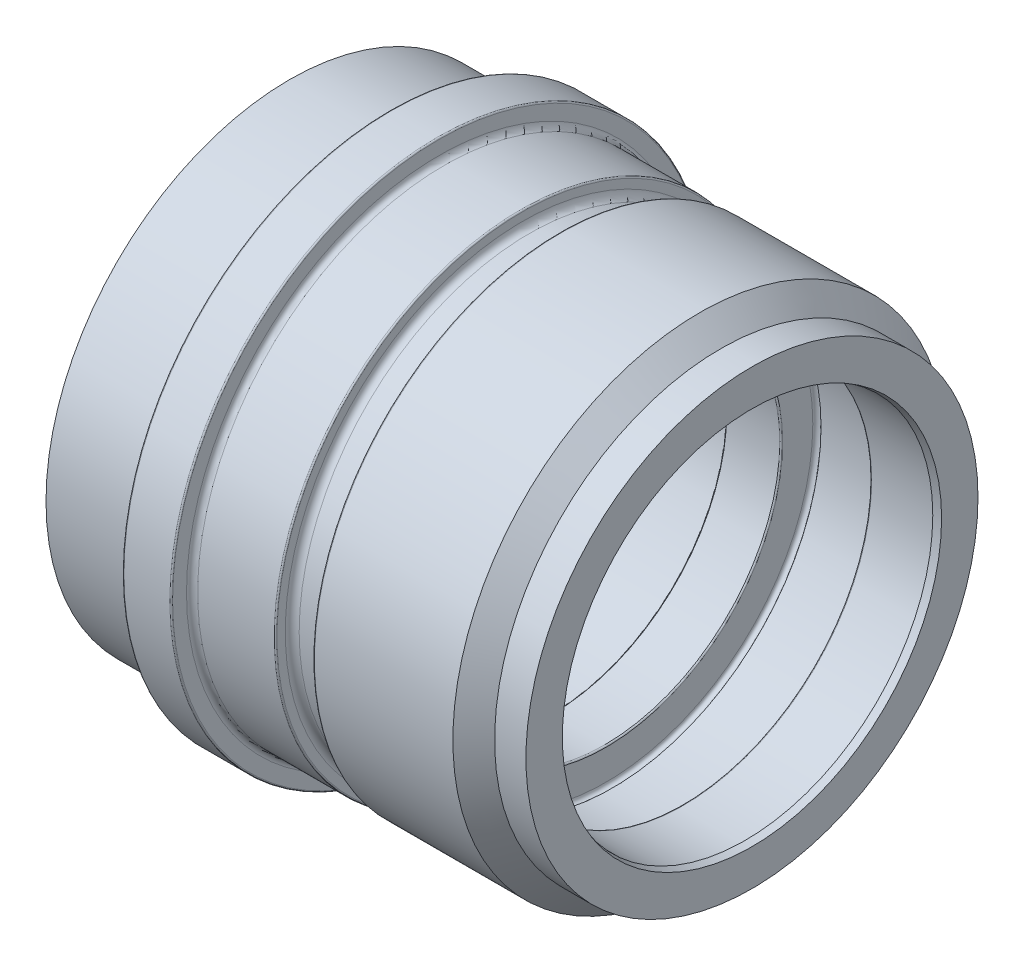
ISO-10303-21;
HEADER;
FILE_DESCRIPTION(('STEP AP214'),'2;1');
FILE_NAME('part.step','',(''),(''),'','','');
FILE_SCHEMA(('AUTOMOTIVE_DESIGN { 1 0 10303 214 1 1 1 1 }'));
ENDSEC;
DATA;
#1=APPLICATION_CONTEXT('core data for automotive mechanical design processes');
#2=APPLICATION_PROTOCOL_DEFINITION('international standard','automotive_design',2000,#1);
#3=PRODUCT_CONTEXT('',#1,'mechanical');
#4=PRODUCT('Part','Part','',(#3));
#5=PRODUCT_RELATED_PRODUCT_CATEGORY('part','',(#4));
#6=PRODUCT_DEFINITION_FORMATION('','',#4);
#7=PRODUCT_DEFINITION_CONTEXT('part definition',#1,'design');
#8=PRODUCT_DEFINITION('design','',#6,#7);
#9=PRODUCT_DEFINITION_SHAPE('','',#8);
#10=(LENGTH_UNIT() NAMED_UNIT(*) SI_UNIT(.MILLI.,.METRE.));
#11=(NAMED_UNIT(*) PLANE_ANGLE_UNIT() SI_UNIT($,.RADIAN.));
#12=(NAMED_UNIT(*) SI_UNIT($,.STERADIAN.) SOLID_ANGLE_UNIT());
#13=UNCERTAINTY_MEASURE_WITH_UNIT(LENGTH_MEASURE(1.E-05),#10,'distance_accuracy_value','');
#14=(GEOMETRIC_REPRESENTATION_CONTEXT(3) GLOBAL_UNCERTAINTY_ASSIGNED_CONTEXT((#13)) GLOBAL_UNIT_ASSIGNED_CONTEXT((#10,
#11,#12)) REPRESENTATION_CONTEXT('',''));
#15=CARTESIAN_POINT('',(0.,0.,0.));
#16=DIRECTION('',(0.,0.,1.));
#17=DIRECTION('',(1.,0.,0.));
#18=AXIS2_PLACEMENT_3D('',#15,#16,#17);
#19=CARTESIAN_POINT('',(-21.5,35.,0.));
#20=DIRECTION('',(-1.,0.,0.));
#21=DIRECTION('',(0.,0.,1.));
#22=AXIS2_PLACEMENT_3D('',#19,#20,#21);
#23=PLANE('',#22);
#24=CARTESIAN_POINT('',(-21.5,0.,0.));
#25=DIRECTION('',(1.,0.,0.));
#26=DIRECTION('',(0.,0.,-1.));
#27=AXIS2_PLACEMENT_3D('',#24,#25,#26);
#28=CIRCLE('',#27,30.5773502691896);
#29=CARTESIAN_POINT('',(-21.5,0.,-30.5773502691896));
#30=VERTEX_POINT('',#29);
#31=EDGE_CURVE('E168',#30,#30,#28,.T.);
#32=ORIENTED_EDGE('',*,*,#31,.T.);
#33=EDGE_LOOP('',(#32));
#34=FACE_BOUND('',#33,.T.);
#35=CARTESIAN_POINT('',(-21.5,0.,0.));
#36=DIRECTION('',(1.,0.,0.));
#37=DIRECTION('',(0.,0.,-1.));
#38=AXIS2_PLACEMENT_3D('',#35,#36,#37);
#39=CIRCLE('',#38,35.);
#40=CARTESIAN_POINT('',(-21.5,0.,-35.));
#41=VERTEX_POINT('',#40);
#42=EDGE_CURVE('E10',#41,#41,#39,.T.);
#43=ORIENTED_EDGE('',*,*,#42,.F.);
#44=EDGE_LOOP('',(#43));
#45=FACE_BOUND('',#44,.T.);
#46=ADVANCED_FACE('F35',(#34,#45),#23,.T.);
#47=CARTESIAN_POINT('',(0.,0.,0.));
#48=DIRECTION('',(1.,0.,0.));
#49=DIRECTION('',(0.,0.,-1.));
#50=AXIS2_PLACEMENT_3D('',#47,#48,#49);
#51=CYLINDRICAL_SURFACE('',#50,35.);
#52=ORIENTED_EDGE('',*,*,#42,.T.);
#53=EDGE_LOOP('',(#52));
#54=FACE_BOUND('',#53,.T.);
#55=CARTESIAN_POINT('',(-7.2,0.,0.));
#56=DIRECTION('',(1.,0.,0.));
#57=DIRECTION('',(0.,0.,-1.));
#58=AXIS2_PLACEMENT_3D('',#55,#56,#57);
#59=CIRCLE('',#58,35.);
#60=CARTESIAN_POINT('',(-7.2,0.,-35.));
#61=VERTEX_POINT('',#60);
#62=EDGE_CURVE('E41',#61,#61,#59,.T.);
#63=ORIENTED_EDGE('',*,*,#62,.F.);
#64=EDGE_LOOP('',(#63));
#65=FACE_BOUND('',#64,.T.);
#66=ADVANCED_FACE('F186',(#54,#65),#51,.T.);
#67=CARTESIAN_POINT('',(-7.2,0.,0.));
#68=DIRECTION('',(1.,0.,0.));
#69=DIRECTION('',(0.,0.,-1.));
#70=AXIS2_PLACEMENT_3D('',#67,#68,#69);
#71=TOROIDAL_SURFACE('',#70,35.2,0.199999999999999);
#72=ORIENTED_EDGE('',*,*,#62,.T.);
#73=EDGE_LOOP('',(#72));
#74=FACE_BOUND('',#73,.T.);
#75=CARTESIAN_POINT('',(-7.,0.,0.));
#76=DIRECTION('',(1.,0.,0.));
#77=DIRECTION('',(0.,0.,-1.));
#78=AXIS2_PLACEMENT_3D('',#75,#76,#77);
#79=CIRCLE('',#78,35.2);
#80=CARTESIAN_POINT('',(-7.,0.,-35.2));
#81=VERTEX_POINT('',#80);
#82=EDGE_CURVE('E45',#81,#81,#79,.T.);
#83=ORIENTED_EDGE('',*,*,#82,.F.);
#84=EDGE_LOOP('',(#83));
#85=FACE_BOUND('',#84,.T.);
#86=ADVANCED_FACE('F190',(#74,#85),#71,.F.);
#87=CARTESIAN_POINT('',(-7.,38.3,0.));
#88=DIRECTION('',(-1.,0.,0.));
#89=DIRECTION('',(0.,0.,1.));
#90=AXIS2_PLACEMENT_3D('',#87,#88,#89);
#91=PLANE('',#90);
#92=ORIENTED_EDGE('',*,*,#82,.T.);
#93=EDGE_LOOP('',(#92));
#94=FACE_BOUND('',#93,.T.);
#95=CARTESIAN_POINT('',(-7.,0.,0.));
#96=DIRECTION('',(1.,0.,0.));
#97=DIRECTION('',(0.,0.,-1.));
#98=AXIS2_PLACEMENT_3D('',#95,#96,#97);
#99=CIRCLE('',#98,38.3);
#100=CARTESIAN_POINT('',(-7.,0.,-38.3));
#101=VERTEX_POINT('',#100);
#102=EDGE_CURVE('E49',#101,#101,#99,.T.);
#103=ORIENTED_EDGE('',*,*,#102,.F.);
#104=EDGE_LOOP('',(#103));
#105=FACE_BOUND('',#104,.T.);
#106=ADVANCED_FACE('F194',(#94,#105),#91,.T.);
#107=CARTESIAN_POINT('',(-6.8,0.,0.));
#108=DIRECTION('',(1.,0.,0.));
#109=DIRECTION('',(0.,0.,-1.));
#110=AXIS2_PLACEMENT_3D('',#107,#108,#109);
#111=TOROIDAL_SURFACE('',#110,38.3,0.199999999999999);
#112=ORIENTED_EDGE('',*,*,#102,.T.);
#113=EDGE_LOOP('',(#112));
#114=FACE_BOUND('',#113,.T.);
#115=CARTESIAN_POINT('',(-6.8,0.,0.));
#116=DIRECTION('',(1.,0.,0.));
#117=DIRECTION('',(0.,0.,-1.));
#118=AXIS2_PLACEMENT_3D('',#115,#116,#117);
#119=CIRCLE('',#118,38.5);
#120=CARTESIAN_POINT('',(-6.8,0.,-38.5));
#121=VERTEX_POINT('',#120);
#122=EDGE_CURVE('E54',#121,#121,#119,.T.);
#123=ORIENTED_EDGE('',*,*,#122,.F.);
#124=EDGE_LOOP('',(#123));
#125=FACE_BOUND('',#124,.T.);
#126=ADVANCED_FACE('F200',(#114,#125),#111,.T.);
#127=CARTESIAN_POINT('',(0.,0.,0.));
#128=DIRECTION('',(1.,0.,0.));
#129=DIRECTION('',(0.,0.,-1.));
#130=AXIS2_PLACEMENT_3D('',#127,#128,#129);
#131=CYLINDRICAL_SURFACE('',#130,38.5);
#132=ORIENTED_EDGE('',*,*,#122,.T.);
#133=EDGE_LOOP('',(#132));
#134=FACE_BOUND('',#133,.T.);
#135=CARTESIAN_POINT('',(-0.200000000000001,0.,0.));
#136=DIRECTION('',(1.,0.,0.));
#137=DIRECTION('',(0.,0.,-1.));
#138=AXIS2_PLACEMENT_3D('',#135,#136,#137);
#139=CIRCLE('',#138,38.5);
#140=CARTESIAN_POINT('',(-0.200000000000001,0.,-38.5));
#141=VERTEX_POINT('',#140);
#142=EDGE_CURVE('E57',#141,#141,#139,.T.);
#143=ORIENTED_EDGE('',*,*,#142,.F.);
#144=EDGE_LOOP('',(#143));
#145=FACE_BOUND('',#144,.T.);
#146=ADVANCED_FACE('F204',(#134,#145),#131,.T.);
#147=CARTESIAN_POINT('',(-0.2,0.,0.));
#148=DIRECTION('',(1.,0.,0.));
#149=DIRECTION('',(0.,0.,-1.));
#150=AXIS2_PLACEMENT_3D('',#147,#148,#149);
#151=TOROIDAL_SURFACE('',#150,38.3,0.199999999999999);
#152=ORIENTED_EDGE('',*,*,#142,.T.);
#153=EDGE_LOOP('',(#152));
#154=FACE_BOUND('',#153,.T.);
#155=CARTESIAN_POINT('',(0.,0.,0.));
#156=DIRECTION('',(1.,0.,0.));
#157=DIRECTION('',(0.,0.,-1.));
#158=AXIS2_PLACEMENT_3D('',#155,#156,#157);
#159=CIRCLE('',#158,38.3);
#160=CARTESIAN_POINT('',(0.,0.,-38.3));
#161=VERTEX_POINT('',#160);
#162=EDGE_CURVE('E60',#161,#161,#159,.T.);
#163=ORIENTED_EDGE('',*,*,#162,.F.);
#164=EDGE_LOOP('',(#163));
#165=FACE_BOUND('',#164,.T.);
#166=ADVANCED_FACE('F208',(#154,#165),#151,.T.);
#167=CARTESIAN_POINT('',(0.,36.3,0.));
#168=DIRECTION('',(1.,0.,0.));
#169=DIRECTION('',(0.,0.,-1.));
#170=AXIS2_PLACEMENT_3D('',#167,#168,#169);
#171=PLANE('',#170);
#172=ORIENTED_EDGE('',*,*,#162,.T.);
#173=EDGE_LOOP('',(#172));
#174=FACE_BOUND('',#173,.T.);
#175=CARTESIAN_POINT('',(0.,0.,0.));
#176=DIRECTION('',(1.,0.,0.));
#177=DIRECTION('',(0.,0.,-1.));
#178=AXIS2_PLACEMENT_3D('',#175,#176,#177);
#179=CIRCLE('',#178,36.3);
#180=CARTESIAN_POINT('',(0.,0.,-36.3));
#181=VERTEX_POINT('',#180);
#182=EDGE_CURVE('E63',#181,#181,#179,.T.);
#183=ORIENTED_EDGE('',*,*,#182,.F.);
#184=EDGE_LOOP('',(#183));
#185=FACE_BOUND('',#184,.T.);
#186=ADVANCED_FACE('F212',(#174,#185),#171,.T.);
#187=CARTESIAN_POINT('',(0.8,0.,0.));
#188=DIRECTION('',(1.,0.,0.));
#189=DIRECTION('',(0.,0.,-1.));
#190=AXIS2_PLACEMENT_3D('',#187,#188,#189);
#191=TOROIDAL_SURFACE('',#190,36.3,0.800000000000001);
#192=CARTESIAN_POINT('',(0.800000000000005,0.,0.));
#193=DIRECTION('',(1.,0.,0.));
#194=DIRECTION('',(0.,0.,-1.));
#195=AXIS2_PLACEMENT_3D('',#192,#193,#194);
#196=CIRCLE('',#195,35.5);
#197=CARTESIAN_POINT('',(0.800000000000005,0.,-35.5));
#198=VERTEX_POINT('',#197);
#199=EDGE_CURVE('E66',#198,#198,#196,.T.);
#200=ORIENTED_EDGE('',*,*,#199,.F.);
#201=EDGE_LOOP('',(#200));
#202=FACE_BOUND('',#201,.T.);
#203=ORIENTED_EDGE('',*,*,#182,.T.);
#204=EDGE_LOOP('',(#203));
#205=FACE_BOUND('',#204,.T.);
#206=ADVANCED_FACE('F216',(#202,#205),#191,.F.);
#207=CARTESIAN_POINT('',(0.,0.,0.));
#208=DIRECTION('',(1.,0.,0.));
#209=DIRECTION('',(0.,0.,-1.));
#210=AXIS2_PLACEMENT_3D('',#207,#208,#209);
#211=CYLINDRICAL_SURFACE('',#210,35.5);
#212=ORIENTED_EDGE('',*,*,#199,.T.);
#213=EDGE_LOOP('',(#212));
#214=FACE_BOUND('',#213,.T.);
#215=CARTESIAN_POINT('',(11.8,0.,0.));
#216=DIRECTION('',(1.,0.,0.));
#217=DIRECTION('',(0.,0.,-1.));
#218=AXIS2_PLACEMENT_3D('',#215,#216,#217);
#219=CIRCLE('',#218,35.5);
#220=CARTESIAN_POINT('',(11.8,0.,-35.5));
#221=VERTEX_POINT('',#220);
#222=EDGE_CURVE('E69',#221,#221,#219,.T.);
#223=ORIENTED_EDGE('',*,*,#222,.F.);
#224=EDGE_LOOP('',(#223));
#225=FACE_BOUND('',#224,.T.);
#226=ADVANCED_FACE('F220',(#214,#225),#211,.T.);
#227=CARTESIAN_POINT('',(11.8,0.,0.));
#228=DIRECTION('',(1.,0.,0.));
#229=DIRECTION('',(0.,0.,-1.));
#230=AXIS2_PLACEMENT_3D('',#227,#228,#229);
#231=TOROIDAL_SURFACE('',#230,35.3,0.2);
#232=ORIENTED_EDGE('',*,*,#222,.T.);
#233=EDGE_LOOP('',(#232));
#234=FACE_BOUND('',#233,.T.);
#235=CARTESIAN_POINT('',(12.,0.,0.));
#236=DIRECTION('',(1.,0.,0.));
#237=DIRECTION('',(0.,0.,-1.));
#238=AXIS2_PLACEMENT_3D('',#235,#236,#237);
#239=CIRCLE('',#238,35.3);
#240=CARTESIAN_POINT('',(12.,0.,-35.3));
#241=VERTEX_POINT('',#240);
#242=EDGE_CURVE('E72',#241,#241,#239,.T.);
#243=ORIENTED_EDGE('',*,*,#242,.F.);
#244=EDGE_LOOP('',(#243));
#245=FACE_BOUND('',#244,.T.);
#246=ADVANCED_FACE('F224',(#234,#245),#231,.T.);
#247=CARTESIAN_POINT('',(12.,34.1,0.));
#248=DIRECTION('',(1.,0.,0.));
#249=DIRECTION('',(0.,0.,-1.));
#250=AXIS2_PLACEMENT_3D('',#247,#248,#249);
#251=PLANE('',#250);
#252=ORIENTED_EDGE('',*,*,#242,.T.);
#253=EDGE_LOOP('',(#252));
#254=FACE_BOUND('',#253,.T.);
#255=CARTESIAN_POINT('',(12.,0.,0.));
#256=DIRECTION('',(1.,0.,0.));
#257=DIRECTION('',(0.,0.,-1.));
#258=AXIS2_PLACEMENT_3D('',#255,#256,#257);
#259=CIRCLE('',#258,34.1);
#260=CARTESIAN_POINT('',(12.,0.,-34.1));
#261=VERTEX_POINT('',#260);
#262=EDGE_CURVE('E75',#261,#261,#259,.T.);
#263=ORIENTED_EDGE('',*,*,#262,.F.);
#264=EDGE_LOOP('',(#263));
#265=FACE_BOUND('',#264,.T.);
#266=ADVANCED_FACE('F228',(#254,#265),#251,.T.);
#267=CARTESIAN_POINT('',(13.,0.,0.));
#268=DIRECTION('',(1.,0.,0.));
#269=DIRECTION('',(0.,0.,-1.));
#270=AXIS2_PLACEMENT_3D('',#267,#268,#269);
#271=TOROIDAL_SURFACE('',#270,34.1,1.);
#272=ORIENTED_EDGE('',*,*,#262,.T.);
#273=EDGE_LOOP('',(#272));
#274=FACE_BOUND('',#273,.T.);
#275=CARTESIAN_POINT('',(13.,0.,0.));
#276=DIRECTION('',(1.,0.,0.));
#277=DIRECTION('',(0.,0.,-1.));
#278=AXIS2_PLACEMENT_3D('',#275,#276,#277);
#279=CIRCLE('',#278,33.1);
#280=CARTESIAN_POINT('',(13.,0.,-33.1));
#281=VERTEX_POINT('',#280);
#282=EDGE_CURVE('E78',#281,#281,#279,.T.);
#283=ORIENTED_EDGE('',*,*,#282,.F.);
#284=EDGE_LOOP('',(#283));
#285=FACE_BOUND('',#284,.T.);
#286=ADVANCED_FACE('F232',(#274,#285),#271,.F.);
#287=CARTESIAN_POINT('',(0.,0.,0.));
#288=DIRECTION('',(1.,0.,0.));
#289=DIRECTION('',(0.,0.,-1.));
#290=AXIS2_PLACEMENT_3D('',#287,#288,#289);
#291=CYLINDRICAL_SURFACE('',#290,33.1);
#292=ORIENTED_EDGE('',*,*,#282,.T.);
#293=EDGE_LOOP('',(#292));
#294=FACE_BOUND('',#293,.T.);
#295=CARTESIAN_POINT('',(16.4,0.,0.));
#296=DIRECTION('',(1.,0.,0.));
#297=DIRECTION('',(0.,0.,-1.));
#298=AXIS2_PLACEMENT_3D('',#295,#296,#297);
#299=CIRCLE('',#298,33.1);
#300=CARTESIAN_POINT('',(16.4,0.,-33.1));
#301=VERTEX_POINT('',#300);
#302=EDGE_CURVE('E81',#301,#301,#299,.T.);
#303=ORIENTED_EDGE('',*,*,#302,.F.);
#304=EDGE_LOOP('',(#303));
#305=FACE_BOUND('',#304,.T.);
#306=ADVANCED_FACE('F236',(#294,#305),#291,.T.);
#307=CARTESIAN_POINT('',(16.4,0.,0.));
#308=DIRECTION('',(1.,0.,0.));
#309=DIRECTION('',(0.,0.,-1.));
#310=AXIS2_PLACEMENT_3D('',#307,#308,#309);
#311=TOROIDAL_SURFACE('',#310,34.1,1.);
#312=ORIENTED_EDGE('',*,*,#302,.T.);
#313=EDGE_LOOP('',(#312));
#314=FACE_BOUND('',#313,.T.);
#315=CARTESIAN_POINT('',(17.4,0.,0.));
#316=DIRECTION('',(1.,0.,0.));
#317=DIRECTION('',(0.,0.,-1.));
#318=AXIS2_PLACEMENT_3D('',#315,#316,#317);
#319=CIRCLE('',#318,34.1);
#320=CARTESIAN_POINT('',(17.4,0.,-34.1));
#321=VERTEX_POINT('',#320);
#322=EDGE_CURVE('E84',#321,#321,#319,.T.);
#323=ORIENTED_EDGE('',*,*,#322,.F.);
#324=EDGE_LOOP('',(#323));
#325=FACE_BOUND('',#324,.T.);
#326=ADVANCED_FACE('F240',(#314,#325),#311,.F.);
#327=CARTESIAN_POINT('',(17.4,35.3,0.));
#328=DIRECTION('',(-1.,0.,0.));
#329=DIRECTION('',(0.,0.,1.));
#330=AXIS2_PLACEMENT_3D('',#327,#328,#329);
#331=PLANE('',#330);
#332=ORIENTED_EDGE('',*,*,#322,.T.);
#333=EDGE_LOOP('',(#332));
#334=FACE_BOUND('',#333,.T.);
#335=CARTESIAN_POINT('',(17.4,0.,0.));
#336=DIRECTION('',(1.,0.,0.));
#337=DIRECTION('',(0.,0.,-1.));
#338=AXIS2_PLACEMENT_3D('',#335,#336,#337);
#339=CIRCLE('',#338,35.3);
#340=CARTESIAN_POINT('',(17.4,0.,-35.3));
#341=VERTEX_POINT('',#340);
#342=EDGE_CURVE('E87',#341,#341,#339,.T.);
#343=ORIENTED_EDGE('',*,*,#342,.F.);
#344=EDGE_LOOP('',(#343));
#345=FACE_BOUND('',#344,.T.);
#346=ADVANCED_FACE('F244',(#334,#345),#331,.T.);
#347=CARTESIAN_POINT('',(17.6,0.,0.));
#348=DIRECTION('',(1.,0.,0.));
#349=DIRECTION('',(0.,0.,-1.));
#350=AXIS2_PLACEMENT_3D('',#347,#348,#349);
#351=TOROIDAL_SURFACE('',#350,35.3,0.199999999999999);
#352=ORIENTED_EDGE('',*,*,#342,.T.);
#353=EDGE_LOOP('',(#352));
#354=FACE_BOUND('',#353,.T.);
#355=CARTESIAN_POINT('',(17.6,0.,0.));
#356=DIRECTION('',(1.,0.,0.));
#357=DIRECTION('',(0.,0.,-1.));
#358=AXIS2_PLACEMENT_3D('',#355,#356,#357);
#359=CIRCLE('',#358,35.5);
#360=CARTESIAN_POINT('',(17.6,0.,-35.5));
#361=VERTEX_POINT('',#360);
#362=EDGE_CURVE('E90',#361,#361,#359,.T.);
#363=ORIENTED_EDGE('',*,*,#362,.F.);
#364=EDGE_LOOP('',(#363));
#365=FACE_BOUND('',#364,.T.);
#366=ADVANCED_FACE('F248',(#354,#365),#351,.T.);
#367=CARTESIAN_POINT('',(0.,0.,0.));
#368=DIRECTION('',(1.,0.,0.));
#369=DIRECTION('',(0.,0.,-1.));
#370=AXIS2_PLACEMENT_3D('',#367,#368,#369);
#371=CYLINDRICAL_SURFACE('',#370,35.5);
#372=ORIENTED_EDGE('',*,*,#362,.T.);
#373=EDGE_LOOP('',(#372));
#374=FACE_BOUND('',#373,.T.);
#375=CARTESIAN_POINT('',(37.5,0.,0.));
#376=DIRECTION('',(1.,0.,0.));
#377=DIRECTION('',(0.,0.,-1.));
#378=AXIS2_PLACEMENT_3D('',#375,#376,#377);
#379=CIRCLE('',#378,35.5);
#380=CARTESIAN_POINT('',(37.5,0.,-35.5));
#381=VERTEX_POINT('',#380);
#382=EDGE_CURVE('E93',#381,#381,#379,.T.);
#383=ORIENTED_EDGE('',*,*,#382,.F.);
#384=EDGE_LOOP('',(#383));
#385=FACE_BOUND('',#384,.T.);
#386=ADVANCED_FACE('F252',(#374,#385),#371,.T.);
#387=CARTESIAN_POINT('',(40.5,0.,0.));
#388=DIRECTION('',(-1.,0.,0.));
#389=DIRECTION('',(0.,0.,1.));
#390=AXIS2_PLACEMENT_3D('',#387,#388,#389);
#391=CONICAL_SURFACE('',#390,32.5,0.78539816339745);
#392=ORIENTED_EDGE('',*,*,#382,.T.);
#393=EDGE_LOOP('',(#392));
#394=FACE_BOUND('',#393,.T.);
#395=CARTESIAN_POINT('',(40.5,0.,0.));
#396=DIRECTION('',(1.,0.,0.));
#397=DIRECTION('',(0.,0.,-1.));
#398=AXIS2_PLACEMENT_3D('',#395,#396,#397);
#399=CIRCLE('',#398,32.5);
#400=CARTESIAN_POINT('',(40.5,0.,-32.5));
#401=VERTEX_POINT('',#400);
#402=EDGE_CURVE('E96',#401,#401,#399,.T.);
#403=ORIENTED_EDGE('',*,*,#402,.F.);
#404=EDGE_LOOP('',(#403));
#405=FACE_BOUND('',#404,.T.);
#406=ADVANCED_FACE('F256',(#394,#405),#391,.T.);
#407=CARTESIAN_POINT('',(0.,0.,0.));
#408=DIRECTION('',(1.,0.,0.));
#409=DIRECTION('',(0.,0.,-1.));
#410=AXIS2_PLACEMENT_3D('',#407,#408,#409);
#411=CYLINDRICAL_SURFACE('',#410,32.5);
#412=ORIENTED_EDGE('',*,*,#402,.T.);
#413=EDGE_LOOP('',(#412));
#414=FACE_BOUND('',#413,.T.);
#415=CARTESIAN_POINT('',(45.,0.,0.));
#416=DIRECTION('',(1.,0.,0.));
#417=DIRECTION('',(0.,0.,-1.));
#418=AXIS2_PLACEMENT_3D('',#415,#416,#417);
#419=CIRCLE('',#418,32.5);
#420=CARTESIAN_POINT('',(45.,0.,-32.5));
#421=VERTEX_POINT('',#420);
#422=EDGE_CURVE('E99',#421,#421,#419,.T.);
#423=ORIENTED_EDGE('',*,*,#422,.F.);
#424=EDGE_LOOP('',(#423));
#425=FACE_BOUND('',#424,.T.);
#426=ADVANCED_FACE('F260',(#414,#425),#411,.T.);
#427=CARTESIAN_POINT('',(45.,27.2679491924311,0.));
#428=DIRECTION('',(1.,0.,0.));
#429=DIRECTION('',(0.,0.,-1.));
#430=AXIS2_PLACEMENT_3D('',#427,#428,#429);
#431=PLANE('',#430);
#432=ORIENTED_EDGE('',*,*,#422,.T.);
#433=EDGE_LOOP('',(#432));
#434=FACE_BOUND('',#433,.T.);
#435=CARTESIAN_POINT('',(45.,0.,0.));
#436=DIRECTION('',(1.,0.,0.));
#437=DIRECTION('',(0.,0.,-1.));
#438=AXIS2_PLACEMENT_3D('',#435,#436,#437);
#439=CIRCLE('',#438,27.2679491924311);
#440=CARTESIAN_POINT('',(45.,0.,-27.2679491924311));
#441=VERTEX_POINT('',#440);
#442=EDGE_CURVE('E102',#441,#441,#439,.T.);
#443=ORIENTED_EDGE('',*,*,#442,.F.);
#444=EDGE_LOOP('',(#443));
#445=FACE_BOUND('',#444,.T.);
#446=ADVANCED_FACE('F264',(#434,#445),#431,.T.);
#447=CARTESIAN_POINT('',(44.,0.,0.));
#448=DIRECTION('',(1.,0.,0.));
#449=DIRECTION('',(0.,0.,-1.));
#450=AXIS2_PLACEMENT_3D('',#447,#448,#449);
#451=CONICAL_SURFACE('',#450,27.,0.26179938779915);
#452=ORIENTED_EDGE('',*,*,#442,.T.);
#453=EDGE_LOOP('',(#452));
#454=FACE_BOUND('',#453,.T.);
#455=CARTESIAN_POINT('',(44.,0.,0.));
#456=DIRECTION('',(1.,0.,0.));
#457=DIRECTION('',(0.,0.,-1.));
#458=AXIS2_PLACEMENT_3D('',#455,#456,#457);
#459=CIRCLE('',#458,27.);
#460=CARTESIAN_POINT('',(44.,0.,-27.));
#461=VERTEX_POINT('',#460);
#462=EDGE_CURVE('E105',#461,#461,#459,.T.);
#463=ORIENTED_EDGE('',*,*,#462,.F.);
#464=EDGE_LOOP('',(#463));
#465=FACE_BOUND('',#464,.T.);
#466=ADVANCED_FACE('F268',(#454,#465),#451,.F.);
#467=CARTESIAN_POINT('',(0.,0.,0.));
#468=DIRECTION('',(1.,0.,0.));
#469=DIRECTION('',(0.,0.,-1.));
#470=AXIS2_PLACEMENT_3D('',#467,#468,#469);
#471=CYLINDRICAL_SURFACE('',#470,27.);
#472=ORIENTED_EDGE('',*,*,#462,.T.);
#473=EDGE_LOOP('',(#472));
#474=FACE_BOUND('',#473,.T.);
#475=CARTESIAN_POINT('',(35.2,0.,0.));
#476=DIRECTION('',(1.,0.,0.));
#477=DIRECTION('',(0.,0.,-1.));
#478=AXIS2_PLACEMENT_3D('',#475,#476,#477);
#479=CIRCLE('',#478,27.);
#480=CARTESIAN_POINT('',(35.2,0.,-27.));
#481=VERTEX_POINT('',#480);
#482=EDGE_CURVE('E108',#481,#481,#479,.T.);
#483=ORIENTED_EDGE('',*,*,#482,.F.);
#484=EDGE_LOOP('',(#483));
#485=FACE_BOUND('',#484,.T.);
#486=ADVANCED_FACE('F272',(#474,#485),#471,.F.);
#487=CARTESIAN_POINT('',(35.2,0.,0.));
#488=DIRECTION('',(1.,0.,0.));
#489=DIRECTION('',(0.,0.,-1.));
#490=AXIS2_PLACEMENT_3D('',#487,#488,#489);
#491=TOROIDAL_SURFACE('',#490,27.2,0.199999999999999);
#492=ORIENTED_EDGE('',*,*,#482,.T.);
#493=EDGE_LOOP('',(#492));
#494=FACE_BOUND('',#493,.T.);
#495=CARTESIAN_POINT('',(35.,0.,0.));
#496=DIRECTION('',(1.,0.,0.));
#497=DIRECTION('',(0.,0.,-1.));
#498=AXIS2_PLACEMENT_3D('',#495,#496,#497);
#499=CIRCLE('',#498,27.2);
#500=CARTESIAN_POINT('',(35.,0.,-27.2));
#501=VERTEX_POINT('',#500);
#502=EDGE_CURVE('E111',#501,#501,#499,.T.);
#503=ORIENTED_EDGE('',*,*,#502,.F.);
#504=EDGE_LOOP('',(#503));
#505=FACE_BOUND('',#504,.T.);
#506=ADVANCED_FACE('F276',(#494,#505),#491,.T.);
#507=CARTESIAN_POINT('',(35.,29.6,0.));
#508=DIRECTION('',(-1.,0.,0.));
#509=DIRECTION('',(0.,0.,1.));
#510=AXIS2_PLACEMENT_3D('',#507,#508,#509);
#511=PLANE('',#510);
#512=ORIENTED_EDGE('',*,*,#502,.T.);
#513=EDGE_LOOP('',(#512));
#514=FACE_BOUND('',#513,.T.);
#515=CARTESIAN_POINT('',(35.,0.,0.));
#516=DIRECTION('',(1.,0.,0.));
#517=DIRECTION('',(0.,0.,-1.));
#518=AXIS2_PLACEMENT_3D('',#515,#516,#517);
#519=CIRCLE('',#518,29.6);
#520=CARTESIAN_POINT('',(35.,0.,-29.6));
#521=VERTEX_POINT('',#520);
#522=EDGE_CURVE('E114',#521,#521,#519,.T.);
#523=ORIENTED_EDGE('',*,*,#522,.F.);
#524=EDGE_LOOP('',(#523));
#525=FACE_BOUND('',#524,.T.);
#526=ADVANCED_FACE('F280',(#514,#525),#511,.T.);
#527=CARTESIAN_POINT('',(34.6,0.,0.));
#528=DIRECTION('',(1.,0.,0.));
#529=DIRECTION('',(0.,0.,-1.));
#530=AXIS2_PLACEMENT_3D('',#527,#528,#529);
#531=TOROIDAL_SURFACE('',#530,29.6,0.399999999999999);
#532=ORIENTED_EDGE('',*,*,#522,.T.);
#533=EDGE_LOOP('',(#532));
#534=FACE_BOUND('',#533,.T.);
#535=CARTESIAN_POINT('',(34.6,0.,0.));
#536=DIRECTION('',(1.,0.,0.));
#537=DIRECTION('',(0.,0.,-1.));
#538=AXIS2_PLACEMENT_3D('',#535,#536,#537);
#539=CIRCLE('',#538,30.);
#540=CARTESIAN_POINT('',(34.6,0.,-30.));
#541=VERTEX_POINT('',#540);
#542=EDGE_CURVE('E117',#541,#541,#539,.T.);
#543=ORIENTED_EDGE('',*,*,#542,.F.);
#544=EDGE_LOOP('',(#543));
#545=FACE_BOUND('',#544,.T.);
#546=ADVANCED_FACE('F284',(#534,#545),#531,.F.);
#547=CARTESIAN_POINT('',(0.,0.,0.));
#548=DIRECTION('',(1.,0.,0.));
#549=DIRECTION('',(0.,0.,-1.));
#550=AXIS2_PLACEMENT_3D('',#547,#548,#549);
#551=CYLINDRICAL_SURFACE('',#550,30.);
#552=ORIENTED_EDGE('',*,*,#542,.T.);
#553=EDGE_LOOP('',(#552));
#554=FACE_BOUND('',#553,.T.);
#555=CARTESIAN_POINT('',(24.9330127018922,0.,0.));
#556=DIRECTION('',(1.,0.,0.));
#557=DIRECTION('',(0.,0.,-1.));
#558=AXIS2_PLACEMENT_3D('',#555,#556,#557);
#559=CIRCLE('',#558,30.);
#560=CARTESIAN_POINT('',(24.9330127018922,0.,-30.));
#561=VERTEX_POINT('',#560);
#562=EDGE_CURVE('E120',#561,#561,#559,.T.);
#563=ORIENTED_EDGE('',*,*,#562,.F.);
#564=EDGE_LOOP('',(#563));
#565=FACE_BOUND('',#564,.T.);
#566=ADVANCED_FACE('F288',(#554,#565),#551,.F.);
#567=CARTESIAN_POINT('',(24.5,0.,0.));
#568=DIRECTION('',(1.,0.,0.));
#569=DIRECTION('',(0.,0.,-1.));
#570=AXIS2_PLACEMENT_3D('',#567,#568,#569);
#571=TOROIDAL_SURFACE('',#570,29.75,0.500000000000001);
#572=ORIENTED_EDGE('',*,*,#562,.T.);
#573=EDGE_LOOP('',(#572));
#574=FACE_BOUND('',#573,.T.);
#575=CARTESIAN_POINT('',(24.,0.,0.));
#576=DIRECTION('',(1.,0.,0.));
#577=DIRECTION('',(0.,0.,-1.));
#578=AXIS2_PLACEMENT_3D('',#575,#576,#577);
#579=CIRCLE('',#578,29.75);
#580=CARTESIAN_POINT('',(24.,0.,-29.75));
#581=VERTEX_POINT('',#580);
#582=EDGE_CURVE('E123',#581,#581,#579,.T.);
#583=ORIENTED_EDGE('',*,*,#582,.F.);
#584=EDGE_LOOP('',(#583));
#585=FACE_BOUND('',#584,.T.);
#586=ADVANCED_FACE('F292',(#574,#585),#571,.F.);
#587=CARTESIAN_POINT('',(24.,25.4,0.));
#588=DIRECTION('',(1.,0.,0.));
#589=DIRECTION('',(0.,0.,-1.));
#590=AXIS2_PLACEMENT_3D('',#587,#588,#589);
#591=PLANE('',#590);
#592=ORIENTED_EDGE('',*,*,#582,.T.);
#593=EDGE_LOOP('',(#592));
#594=FACE_BOUND('',#593,.T.);
#595=CARTESIAN_POINT('',(24.,0.,0.));
#596=DIRECTION('',(1.,0.,0.));
#597=DIRECTION('',(0.,0.,-1.));
#598=AXIS2_PLACEMENT_3D('',#595,#596,#597);
#599=CIRCLE('',#598,25.4);
#600=CARTESIAN_POINT('',(24.,0.,-25.4));
#601=VERTEX_POINT('',#600);
#602=EDGE_CURVE('E126',#601,#601,#599,.T.);
#603=ORIENTED_EDGE('',*,*,#602,.F.);
#604=EDGE_LOOP('',(#603));
#605=FACE_BOUND('',#604,.T.);
#606=ADVANCED_FACE('F296',(#594,#605),#591,.T.);
#607=CARTESIAN_POINT('',(23.8,0.,0.));
#608=DIRECTION('',(1.,0.,0.));
#609=DIRECTION('',(0.,0.,-1.));
#610=AXIS2_PLACEMENT_3D('',#607,#608,#609);
#611=TOROIDAL_SURFACE('',#610,25.4,0.199999999999997);
#612=ORIENTED_EDGE('',*,*,#602,.T.);
#613=EDGE_LOOP('',(#612));
#614=FACE_BOUND('',#613,.T.);
#615=CARTESIAN_POINT('',(23.8,0.,0.));
#616=DIRECTION('',(1.,0.,0.));
#617=DIRECTION('',(0.,0.,-1.));
#618=AXIS2_PLACEMENT_3D('',#615,#616,#617);
#619=CIRCLE('',#618,25.2);
#620=CARTESIAN_POINT('',(23.8,0.,-25.2));
#621=VERTEX_POINT('',#620);
#622=EDGE_CURVE('E129',#621,#621,#619,.T.);
#623=ORIENTED_EDGE('',*,*,#622,.F.);
#624=EDGE_LOOP('',(#623));
#625=FACE_BOUND('',#624,.T.);
#626=ADVANCED_FACE('F300',(#614,#625),#611,.T.);
#627=CARTESIAN_POINT('',(0.,0.,0.));
#628=DIRECTION('',(1.,0.,0.));
#629=DIRECTION('',(0.,0.,-1.));
#630=AXIS2_PLACEMENT_3D('',#627,#628,#629);
#631=CYLINDRICAL_SURFACE('',#630,25.2);
#632=ORIENTED_EDGE('',*,*,#622,.T.);
#633=EDGE_LOOP('',(#632));
#634=FACE_BOUND('',#633,.T.);
#635=CARTESIAN_POINT('',(16.2,0.,0.));
#636=DIRECTION('',(1.,0.,0.));
#637=DIRECTION('',(0.,0.,-1.));
#638=AXIS2_PLACEMENT_3D('',#635,#636,#637);
#639=CIRCLE('',#638,25.2);
#640=CARTESIAN_POINT('',(16.2,0.,-25.2));
#641=VERTEX_POINT('',#640);
#642=EDGE_CURVE('E132',#641,#641,#639,.T.);
#643=ORIENTED_EDGE('',*,*,#642,.F.);
#644=EDGE_LOOP('',(#643));
#645=FACE_BOUND('',#644,.T.);
#646=ADVANCED_FACE('F304',(#634,#645),#631,.F.);
#647=CARTESIAN_POINT('',(16.2,0.,0.));
#648=DIRECTION('',(1.,0.,0.));
#649=DIRECTION('',(0.,0.,-1.));
#650=AXIS2_PLACEMENT_3D('',#647,#648,#649);
#651=TOROIDAL_SURFACE('',#650,25.4,0.199999999999997);
#652=ORIENTED_EDGE('',*,*,#642,.T.);
#653=EDGE_LOOP('',(#652));
#654=FACE_BOUND('',#653,.T.);
#655=CARTESIAN_POINT('',(16.,0.,0.));
#656=DIRECTION('',(1.,0.,0.));
#657=DIRECTION('',(0.,0.,-1.));
#658=AXIS2_PLACEMENT_3D('',#655,#656,#657);
#659=CIRCLE('',#658,25.4);
#660=CARTESIAN_POINT('',(16.,0.,-25.4));
#661=VERTEX_POINT('',#660);
#662=EDGE_CURVE('E135',#661,#661,#659,.T.);
#663=ORIENTED_EDGE('',*,*,#662,.F.);
#664=EDGE_LOOP('',(#663));
#665=FACE_BOUND('',#664,.T.);
#666=ADVANCED_FACE('F308',(#654,#665),#651,.T.);
#667=CARTESIAN_POINT('',(16.,27.3,0.));
#668=DIRECTION('',(-1.,0.,0.));
#669=DIRECTION('',(0.,0.,1.));
#670=AXIS2_PLACEMENT_3D('',#667,#668,#669);
#671=PLANE('',#670);
#672=ORIENTED_EDGE('',*,*,#662,.T.);
#673=EDGE_LOOP('',(#672));
#674=FACE_BOUND('',#673,.T.);
#675=CARTESIAN_POINT('',(16.,0.,0.));
#676=DIRECTION('',(1.,0.,0.));
#677=DIRECTION('',(0.,0.,-1.));
#678=AXIS2_PLACEMENT_3D('',#675,#676,#677);
#679=CIRCLE('',#678,27.3);
#680=CARTESIAN_POINT('',(16.,0.,-27.3));
#681=VERTEX_POINT('',#680);
#682=EDGE_CURVE('E138',#681,#681,#679,.T.);
#683=ORIENTED_EDGE('',*,*,#682,.F.);
#684=EDGE_LOOP('',(#683));
#685=FACE_BOUND('',#684,.T.);
#686=ADVANCED_FACE('F312',(#674,#685),#671,.T.);
#687=CARTESIAN_POINT('',(15.8,0.,0.));
#688=DIRECTION('',(1.,0.,0.));
#689=DIRECTION('',(0.,0.,-1.));
#690=AXIS2_PLACEMENT_3D('',#687,#688,#689);
#691=TOROIDAL_SURFACE('',#690,27.3,0.199999999999999);
#692=ORIENTED_EDGE('',*,*,#682,.T.);
#693=EDGE_LOOP('',(#692));
#694=FACE_BOUND('',#693,.T.);
#695=CARTESIAN_POINT('',(15.8,0.,0.));
#696=DIRECTION('',(1.,0.,0.));
#697=DIRECTION('',(0.,0.,-1.));
#698=AXIS2_PLACEMENT_3D('',#695,#696,#697);
#699=CIRCLE('',#698,27.5);
#700=CARTESIAN_POINT('',(15.8,0.,-27.5));
#701=VERTEX_POINT('',#700);
#702=EDGE_CURVE('E141',#701,#701,#699,.T.);
#703=ORIENTED_EDGE('',*,*,#702,.F.);
#704=EDGE_LOOP('',(#703));
#705=FACE_BOUND('',#704,.T.);
#706=ADVANCED_FACE('F316',(#694,#705),#691,.F.);
#707=CARTESIAN_POINT('',(0.,0.,0.));
#708=DIRECTION('',(1.,0.,0.));
#709=DIRECTION('',(0.,0.,-1.));
#710=AXIS2_PLACEMENT_3D('',#707,#708,#709);
#711=CYLINDRICAL_SURFACE('',#710,27.5);
#712=ORIENTED_EDGE('',*,*,#702,.T.);
#713=EDGE_LOOP('',(#712));
#714=FACE_BOUND('',#713,.T.);
#715=CARTESIAN_POINT('',(-8.8,0.,0.));
#716=DIRECTION('',(1.,0.,0.));
#717=DIRECTION('',(0.,0.,-1.));
#718=AXIS2_PLACEMENT_3D('',#715,#716,#717);
#719=CIRCLE('',#718,27.5);
#720=CARTESIAN_POINT('',(-8.8,0.,-27.5));
#721=VERTEX_POINT('',#720);
#722=EDGE_CURVE('E144',#721,#721,#719,.T.);
#723=ORIENTED_EDGE('',*,*,#722,.F.);
#724=EDGE_LOOP('',(#723));
#725=FACE_BOUND('',#724,.T.);
#726=ADVANCED_FACE('F320',(#714,#725),#711,.F.);
#727=CARTESIAN_POINT('',(-8.8,0.,0.));
#728=DIRECTION('',(1.,0.,0.));
#729=DIRECTION('',(0.,0.,-1.));
#730=AXIS2_PLACEMENT_3D('',#727,#728,#729);
#731=TOROIDAL_SURFACE('',#730,27.3,0.2);
#732=ORIENTED_EDGE('',*,*,#722,.T.);
#733=EDGE_LOOP('',(#732));
#734=FACE_BOUND('',#733,.T.);
#735=CARTESIAN_POINT('',(-9.,0.,0.));
#736=DIRECTION('',(1.,0.,0.));
#737=DIRECTION('',(0.,0.,-1.));
#738=AXIS2_PLACEMENT_3D('',#735,#736,#737);
#739=CIRCLE('',#738,27.3);
#740=CARTESIAN_POINT('',(-9.,0.,-27.3));
#741=VERTEX_POINT('',#740);
#742=EDGE_CURVE('E147',#741,#741,#739,.T.);
#743=ORIENTED_EDGE('',*,*,#742,.F.);
#744=EDGE_LOOP('',(#743));
#745=FACE_BOUND('',#744,.T.);
#746=ADVANCED_FACE('F324',(#734,#745),#731,.F.);
#747=CARTESIAN_POINT('',(-9.,25.7,0.));
#748=DIRECTION('',(1.,0.,0.));
#749=DIRECTION('',(0.,0.,-1.));
#750=AXIS2_PLACEMENT_3D('',#747,#748,#749);
#751=PLANE('',#750);
#752=ORIENTED_EDGE('',*,*,#742,.T.);
#753=EDGE_LOOP('',(#752));
#754=FACE_BOUND('',#753,.T.);
#755=CARTESIAN_POINT('',(-9.,0.,0.));
#756=DIRECTION('',(1.,0.,0.));
#757=DIRECTION('',(0.,0.,-1.));
#758=AXIS2_PLACEMENT_3D('',#755,#756,#757);
#759=CIRCLE('',#758,25.7);
#760=CARTESIAN_POINT('',(-9.,0.,-25.7));
#761=VERTEX_POINT('',#760);
#762=EDGE_CURVE('E150',#761,#761,#759,.T.);
#763=ORIENTED_EDGE('',*,*,#762,.F.);
#764=EDGE_LOOP('',(#763));
#765=FACE_BOUND('',#764,.T.);
#766=ADVANCED_FACE('F328',(#754,#765),#751,.T.);
#767=CARTESIAN_POINT('',(-9.2,0.,0.));
#768=DIRECTION('',(1.,0.,0.));
#769=DIRECTION('',(0.,0.,-1.));
#770=AXIS2_PLACEMENT_3D('',#767,#768,#769);
#771=TOROIDAL_SURFACE('',#770,25.7,0.200000000000003);
#772=ORIENTED_EDGE('',*,*,#762,.T.);
#773=EDGE_LOOP('',(#772));
#774=FACE_BOUND('',#773,.T.);
#775=CARTESIAN_POINT('',(-9.2,0.,0.));
#776=DIRECTION('',(1.,0.,0.));
#777=DIRECTION('',(0.,0.,-1.));
#778=AXIS2_PLACEMENT_3D('',#775,#776,#777);
#779=CIRCLE('',#778,25.5);
#780=CARTESIAN_POINT('',(-9.2,0.,-25.5));
#781=VERTEX_POINT('',#780);
#782=EDGE_CURVE('E153',#781,#781,#779,.T.);
#783=ORIENTED_EDGE('',*,*,#782,.F.);
#784=EDGE_LOOP('',(#783));
#785=FACE_BOUND('',#784,.T.);
#786=ADVANCED_FACE('F332',(#774,#785),#771,.T.);
#787=CARTESIAN_POINT('',(0.,0.,0.));
#788=DIRECTION('',(1.,0.,0.));
#789=DIRECTION('',(0.,0.,-1.));
#790=AXIS2_PLACEMENT_3D('',#787,#788,#789);
#791=CYLINDRICAL_SURFACE('',#790,25.5);
#792=ORIENTED_EDGE('',*,*,#782,.T.);
#793=EDGE_LOOP('',(#792));
#794=FACE_BOUND('',#793,.T.);
#795=CARTESIAN_POINT('',(-14.,0.,0.));
#796=DIRECTION('',(1.,0.,0.));
#797=DIRECTION('',(0.,0.,-1.));
#798=AXIS2_PLACEMENT_3D('',#795,#796,#797);
#799=CIRCLE('',#798,25.5);
#800=CARTESIAN_POINT('',(-14.,0.,-25.5));
#801=VERTEX_POINT('',#800);
#802=EDGE_CURVE('E156',#801,#801,#799,.T.);
#803=ORIENTED_EDGE('',*,*,#802,.F.);
#804=EDGE_LOOP('',(#803));
#805=FACE_BOUND('',#804,.T.);
#806=ADVANCED_FACE('F336',(#794,#805),#791,.F.);
#807=CARTESIAN_POINT('',(-14.,29.2,0.));
#808=DIRECTION('',(-1.,0.,0.));
#809=DIRECTION('',(0.,0.,1.));
#810=AXIS2_PLACEMENT_3D('',#807,#808,#809);
#811=PLANE('',#810);
#812=ORIENTED_EDGE('',*,*,#802,.T.);
#813=EDGE_LOOP('',(#812));
#814=FACE_BOUND('',#813,.T.);
#815=CARTESIAN_POINT('',(-14.,0.,0.));
#816=DIRECTION('',(1.,0.,0.));
#817=DIRECTION('',(0.,0.,-1.));
#818=AXIS2_PLACEMENT_3D('',#815,#816,#817);
#819=CIRCLE('',#818,29.2);
#820=CARTESIAN_POINT('',(-14.,0.,-29.2));
#821=VERTEX_POINT('',#820);
#822=EDGE_CURVE('E159',#821,#821,#819,.T.);
#823=ORIENTED_EDGE('',*,*,#822,.F.);
#824=EDGE_LOOP('',(#823));
#825=FACE_BOUND('',#824,.T.);
#826=ADVANCED_FACE('F340',(#814,#825),#811,.T.);
#827=CARTESIAN_POINT('',(-14.8,0.,0.));
#828=DIRECTION('',(1.,0.,0.));
#829=DIRECTION('',(0.,0.,-1.));
#830=AXIS2_PLACEMENT_3D('',#827,#828,#829);
#831=TOROIDAL_SURFACE('',#830,29.2,0.799999999999999);
#832=ORIENTED_EDGE('',*,*,#822,.T.);
#833=EDGE_LOOP('',(#832));
#834=FACE_BOUND('',#833,.T.);
#835=CARTESIAN_POINT('',(-14.8,0.,0.));
#836=DIRECTION('',(1.,0.,0.));
#837=DIRECTION('',(0.,0.,-1.));
#838=AXIS2_PLACEMENT_3D('',#835,#836,#837);
#839=CIRCLE('',#838,30.);
#840=CARTESIAN_POINT('',(-14.8,0.,-30.));
#841=VERTEX_POINT('',#840);
#842=EDGE_CURVE('E162',#841,#841,#839,.T.);
#843=ORIENTED_EDGE('',*,*,#842,.F.);
#844=EDGE_LOOP('',(#843));
#845=FACE_BOUND('',#844,.T.);
#846=ADVANCED_FACE('F182',(#834,#845),#831,.F.);
#847=CARTESIAN_POINT('',(0.,0.,0.));
#848=DIRECTION('',(1.,0.,0.));
#849=DIRECTION('',(0.,0.,-1.));
#850=AXIS2_PLACEMENT_3D('',#847,#848,#849);
#851=CYLINDRICAL_SURFACE('',#850,30.);
#852=ORIENTED_EDGE('',*,*,#842,.T.);
#853=EDGE_LOOP('',(#852));
#854=FACE_BOUND('',#853,.T.);
#855=CARTESIAN_POINT('',(-20.5,0.,0.));
#856=DIRECTION('',(1.,0.,0.));
#857=DIRECTION('',(0.,0.,-1.));
#858=AXIS2_PLACEMENT_3D('',#855,#856,#857);
#859=CIRCLE('',#858,30.);
#860=CARTESIAN_POINT('',(-20.5,0.,-30.));
#861=VERTEX_POINT('',#860);
#862=EDGE_CURVE('E165',#861,#861,#859,.T.);
#863=ORIENTED_EDGE('',*,*,#862,.F.);
#864=EDGE_LOOP('',(#863));
#865=FACE_BOUND('',#864,.T.);
#866=ADVANCED_FACE('F176',(#854,#865),#851,.F.);
#867=CARTESIAN_POINT('',(-21.5,0.,0.));
#868=DIRECTION('',(-1.,0.,0.));
#869=DIRECTION('',(0.,0.,1.));
#870=AXIS2_PLACEMENT_3D('',#867,#868,#869);
#871=CONICAL_SURFACE('',#870,30.5773502691896,0.523598775598299);
#872=ORIENTED_EDGE('',*,*,#862,.T.);
#873=EDGE_LOOP('',(#872));
#874=FACE_BOUND('',#873,.T.);
#875=ORIENTED_EDGE('',*,*,#31,.F.);
#876=EDGE_LOOP('',(#875));
#877=FACE_BOUND('',#876,.T.);
#878=ADVANCED_FACE('F174',(#874,#877),#871,.F.);
#879=CLOSED_SHELL('',(#46,#66,#86,#106,#126,#146,#166,#186,#206,#226,#246,#266,#286,#306,#326,
#346,#366,#386,#406,#426,#446,#466,#486,#506,#526,#546,#566,#586,#606,#626,#646,#666,#686,#706,
#726,#746,#766,#786,#806,#826,#846,#866,#878));
#880=MANIFOLD_SOLID_BREP('B2',#879);
#881=ADVANCED_BREP_SHAPE_REPRESENTATION('',(#18,#880),#14);
#882=SHAPE_DEFINITION_REPRESENTATION(#9,#881);
ENDSEC;
END-ISO-10303-21;
